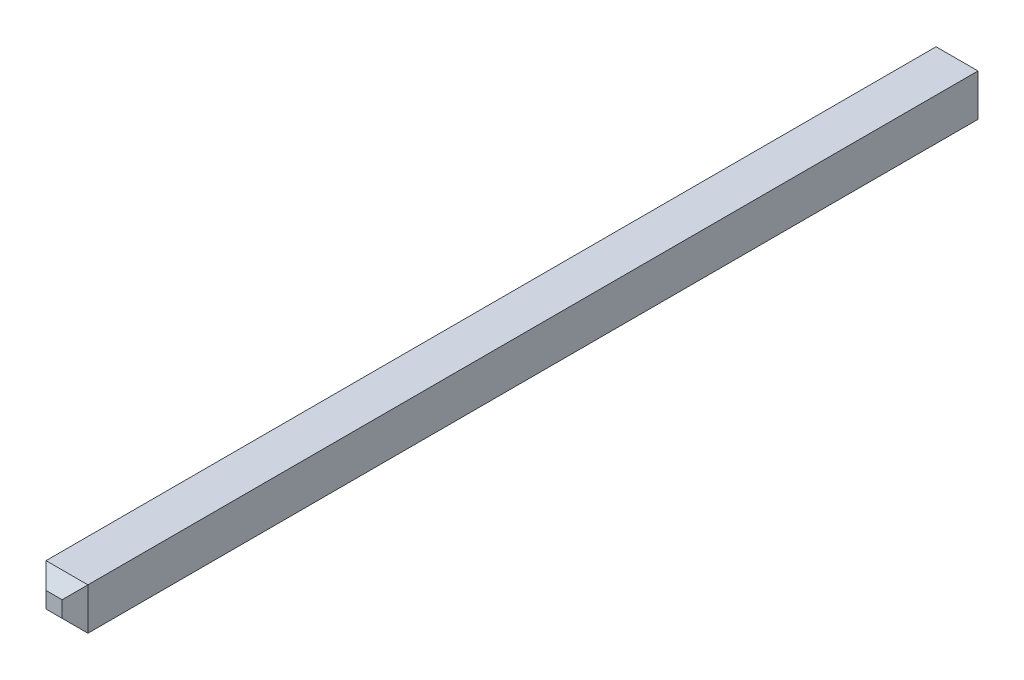
ISO-10303-21;
HEADER;
FILE_DESCRIPTION(('STEP AP214'),'2;1');
FILE_NAME('part.step','',(''),(''),'','','');
FILE_SCHEMA(('AUTOMOTIVE_DESIGN { 1 0 10303 214 1 1 1 1 }'));
ENDSEC;
DATA;
#1=APPLICATION_CONTEXT('core data for automotive mechanical design processes');
#2=APPLICATION_PROTOCOL_DEFINITION('international standard','automotive_design',2000,#1);
#3=PRODUCT_CONTEXT('',#1,'mechanical');
#4=PRODUCT('Part','Part','',(#3));
#5=PRODUCT_RELATED_PRODUCT_CATEGORY('part','',(#4));
#6=PRODUCT_DEFINITION_FORMATION('','',#4);
#7=PRODUCT_DEFINITION_CONTEXT('part definition',#1,'design');
#8=PRODUCT_DEFINITION('design','',#6,#7);
#9=PRODUCT_DEFINITION_SHAPE('','',#8);
#10=(LENGTH_UNIT() NAMED_UNIT(*) SI_UNIT(.MILLI.,.METRE.));
#11=(NAMED_UNIT(*) PLANE_ANGLE_UNIT() SI_UNIT($,.RADIAN.));
#12=(NAMED_UNIT(*) SI_UNIT($,.STERADIAN.) SOLID_ANGLE_UNIT());
#13=UNCERTAINTY_MEASURE_WITH_UNIT(LENGTH_MEASURE(1.E-05),#10,'distance_accuracy_value','');
#14=(GEOMETRIC_REPRESENTATION_CONTEXT(3) GLOBAL_UNCERTAINTY_ASSIGNED_CONTEXT((#13)) GLOBAL_UNIT_ASSIGNED_CONTEXT((#10,
#11,#12)) REPRESENTATION_CONTEXT('',''));
#15=CARTESIAN_POINT('',(0.,0.,0.));
#16=DIRECTION('',(0.,0.,1.));
#17=DIRECTION('',(1.,0.,0.));
#18=AXIS2_PLACEMENT_3D('',#15,#16,#17);
#19=CARTESIAN_POINT('',(-0.225,0.,-0.1));
#20=DIRECTION('',(-0.707106781186548,0.,0.707106781186548));
#21=DIRECTION('',(0.707106781186548,0.,0.707106781186548));
#22=AXIS2_PLACEMENT_3D('',#19,#20,#21);
#23=PLANE('',#22);
#24=DIRECTION('',(0.,1.,0.));
#25=VECTOR('',#24,1.);
#26=CARTESIAN_POINT('',(-0.325,0.325,-0.2));
#27=LINE('',#26,#25);
#28=CARTESIAN_POINT('',(-0.325,-0.325,-0.2));
#29=VERTEX_POINT('',#28);
#30=CARTESIAN_POINT('',(-0.325,0.325,-0.2));
#31=VERTEX_POINT('',#30);
#32=EDGE_CURVE('E112',#29,#31,#27,.T.);
#33=ORIENTED_EDGE('',*,*,#32,.F.);
#34=DIRECTION('',(-0.577350269189626,-0.577350269189626,-0.577350269189626));
#35=VECTOR('',#34,1.);
#36=CARTESIAN_POINT('',(-0.125,-0.125,0.));
#37=LINE('',#36,#35);
#38=CARTESIAN_POINT('',(-0.125,-0.125,0.));
#39=VERTEX_POINT('',#38);
#40=EDGE_CURVE('E110',#39,#29,#37,.T.);
#41=ORIENTED_EDGE('',*,*,#40,.F.);
#42=DIRECTION('',(0.,1.,0.));
#43=VECTOR('',#42,1.);
#44=CARTESIAN_POINT('',(-0.125,0.,0.));
#45=LINE('',#44,#43);
#46=CARTESIAN_POINT('',(-0.125,0.125,0.));
#47=VERTEX_POINT('',#46);
#48=EDGE_CURVE('E19',#47,#39,#45,.F.);
#49=ORIENTED_EDGE('',*,*,#48,.F.);
#50=DIRECTION('',(0.577350269189626,-0.577350269189626,0.577350269189626));
#51=VECTOR('',#50,1.);
#52=CARTESIAN_POINT('',(-0.325,0.325,-0.2));
#53=LINE('',#52,#51);
#54=EDGE_CURVE('E136',#31,#47,#53,.T.);
#55=ORIENTED_EDGE('',*,*,#54,.F.);
#56=EDGE_LOOP('',(#33,#41,#49,#55));
#57=FACE_BOUND('',#56,.T.);
#58=ADVANCED_FACE('F16',(#57),#23,.T.);
#59=CARTESIAN_POINT('',(-0.225,0.,-14.1));
#60=DIRECTION('',(-0.707106781186548,0.,-0.707106781186548));
#61=DIRECTION('',(-0.707106781186548,0.,0.707106781186548));
#62=AXIS2_PLACEMENT_3D('',#59,#60,#61);
#63=PLANE('',#62);
#64=DIRECTION('',(0.,1.,0.));
#65=VECTOR('',#64,1.);
#66=CARTESIAN_POINT('',(-0.125,0.,-14.2));
#67=LINE('',#66,#65);
#68=CARTESIAN_POINT('',(-0.125,0.125,-14.2));
#69=VERTEX_POINT('',#68);
#70=CARTESIAN_POINT('',(-0.125,-0.125,-14.2));
#71=VERTEX_POINT('',#70);
#72=EDGE_CURVE('E93',#69,#71,#67,.F.);
#73=ORIENTED_EDGE('',*,*,#72,.T.);
#74=DIRECTION('',(0.577350269189625,0.577350269189626,-0.577350269189626));
#75=VECTOR('',#74,1.);
#76=CARTESIAN_POINT('',(-0.325,-0.325000000000001,-14.));
#77=LINE('',#76,#75);
#78=CARTESIAN_POINT('',(-0.325,-0.325,-14.));
#79=VERTEX_POINT('',#78);
#80=EDGE_CURVE('E128',#79,#71,#77,.T.);
#81=ORIENTED_EDGE('',*,*,#80,.F.);
#82=DIRECTION('',(0.,1.,0.));
#83=VECTOR('',#82,1.);
#84=CARTESIAN_POINT('',(-0.325,0.325,-14.));
#85=LINE('',#84,#83);
#86=CARTESIAN_POINT('',(-0.325,0.325,-14.));
#87=VERTEX_POINT('',#86);
#88=EDGE_CURVE('E147',#87,#79,#85,.F.);
#89=ORIENTED_EDGE('',*,*,#88,.F.);
#90=DIRECTION('',(-0.577350269189625,0.577350269189626,0.577350269189626));
#91=VECTOR('',#90,1.);
#92=CARTESIAN_POINT('',(-0.125,0.125,-14.2));
#93=LINE('',#92,#91);
#94=EDGE_CURVE('E143',#69,#87,#93,.T.);
#95=ORIENTED_EDGE('',*,*,#94,.F.);
#96=EDGE_LOOP('',(#73,#81,#89,#95));
#97=FACE_BOUND('',#96,.T.);
#98=ADVANCED_FACE('F323',(#97),#63,.T.);
#99=CARTESIAN_POINT('',(0.,0.,0.));
#100=DIRECTION('',(0.,0.,1.));
#101=DIRECTION('',(1.,0.,0.));
#102=AXIS2_PLACEMENT_3D('',#99,#100,#101);
#103=PLANE('',#102);
#104=ORIENTED_EDGE('',*,*,#48,.T.);
#105=DIRECTION('',(1.,0.,0.));
#106=VECTOR('',#105,1.);
#107=CARTESIAN_POINT('',(0.,-0.125,0.));
#108=LINE('',#107,#106);
#109=CARTESIAN_POINT('',(0.125,-0.125,0.));
#110=VERTEX_POINT('',#109);
#111=EDGE_CURVE('E103',#110,#39,#108,.F.);
#112=ORIENTED_EDGE('',*,*,#111,.F.);
#113=DIRECTION('',(0.,1.,0.));
#114=VECTOR('',#113,1.);
#115=CARTESIAN_POINT('',(0.125,0.,0.));
#116=LINE('',#115,#114);
#117=CARTESIAN_POINT('',(0.125,0.125,0.));
#118=VERTEX_POINT('',#117);
#119=EDGE_CURVE('E155',#118,#110,#116,.F.);
#120=ORIENTED_EDGE('',*,*,#119,.F.);
#121=DIRECTION('',(1.,0.,0.));
#122=VECTOR('',#121,1.);
#123=CARTESIAN_POINT('',(0.,0.125,0.));
#124=LINE('',#123,#122);
#125=EDGE_CURVE('E105',#47,#118,#124,.T.);
#126=ORIENTED_EDGE('',*,*,#125,.F.);
#127=EDGE_LOOP('',(#104,#112,#120,#126));
#128=FACE_BOUND('',#127,.T.);
#129=ADVANCED_FACE('F100',(#128),#103,.T.);
#130=CARTESIAN_POINT('',(0.,-0.225,-0.1));
#131=DIRECTION('',(0.,-0.707106781186548,0.707106781186548));
#132=DIRECTION('',(0.,-0.707106781186548,-0.707106781186548));
#133=AXIS2_PLACEMENT_3D('',#130,#131,#132);
#134=PLANE('',#133);
#135=ORIENTED_EDGE('',*,*,#111,.T.);
#136=ORIENTED_EDGE('',*,*,#40,.T.);
#137=DIRECTION('',(1.,0.,0.));
#138=VECTOR('',#137,1.);
#139=CARTESIAN_POINT('',(-0.325,-0.325,-0.2));
#140=LINE('',#139,#138);
#141=CARTESIAN_POINT('',(0.325,-0.325,-0.2));
#142=VERTEX_POINT('',#141);
#143=EDGE_CURVE('E159',#142,#29,#140,.F.);
#144=ORIENTED_EDGE('',*,*,#143,.F.);
#145=DIRECTION('',(0.577350269189626,-0.577350269189626,-0.577350269189626));
#146=VECTOR('',#145,1.);
#147=CARTESIAN_POINT('',(0.125,-0.125,0.));
#148=LINE('',#147,#146);
#149=EDGE_CURVE('E119',#110,#142,#148,.T.);
#150=ORIENTED_EDGE('',*,*,#149,.F.);
#151=EDGE_LOOP('',(#135,#136,#144,#150));
#152=FACE_BOUND('',#151,.T.);
#153=ADVANCED_FACE('F117',(#152),#134,.T.);
#154=CARTESIAN_POINT('',(0.,0.,-14.2));
#155=DIRECTION('',(0.,0.,1.));
#156=DIRECTION('',(1.,0.,0.));
#157=AXIS2_PLACEMENT_3D('',#154,#155,#156);
#158=PLANE('',#157);
#159=DIRECTION('',(0.,1.,0.));
#160=VECTOR('',#159,1.);
#161=CARTESIAN_POINT('',(0.125,0.,-14.2));
#162=LINE('',#161,#160);
#163=CARTESIAN_POINT('',(0.125,-0.125,-14.2));
#164=VERTEX_POINT('',#163);
#165=CARTESIAN_POINT('',(0.125,0.125,-14.2));
#166=VERTEX_POINT('',#165);
#167=EDGE_CURVE('E171',#164,#166,#162,.T.);
#168=ORIENTED_EDGE('',*,*,#167,.F.);
#169=DIRECTION('',(1.,0.,0.));
#170=VECTOR('',#169,1.);
#171=CARTESIAN_POINT('',(0.,-0.125,-14.2));
#172=LINE('',#171,#170);
#173=EDGE_CURVE('E132',#71,#164,#172,.T.);
#174=ORIENTED_EDGE('',*,*,#173,.F.);
#175=ORIENTED_EDGE('',*,*,#72,.F.);
#176=DIRECTION('',(1.,0.,0.));
#177=VECTOR('',#176,1.);
#178=CARTESIAN_POINT('',(0.,0.125,-14.2));
#179=LINE('',#178,#177);
#180=EDGE_CURVE('E140',#166,#69,#179,.F.);
#181=ORIENTED_EDGE('',*,*,#180,.F.);
#182=EDGE_LOOP('',(#168,#174,#175,#181));
#183=FACE_BOUND('',#182,.T.);
#184=ADVANCED_FACE('F299',(#183),#158,.F.);
#185=CARTESIAN_POINT('',(0.,-0.225,-14.1));
#186=DIRECTION('',(0.,-0.707106781186548,-0.707106781186548));
#187=DIRECTION('',(0.,0.707106781186548,-0.707106781186548));
#188=AXIS2_PLACEMENT_3D('',#185,#186,#187);
#189=PLANE('',#188);
#190=ORIENTED_EDGE('',*,*,#173,.T.);
#191=DIRECTION('',(-0.577350269189626,0.577350269189625,-0.577350269189626));
#192=VECTOR('',#191,1.);
#193=CARTESIAN_POINT('',(0.325000000000001,-0.325,-14.));
#194=LINE('',#193,#192);
#195=CARTESIAN_POINT('',(0.325,-0.325,-14.));
#196=VERTEX_POINT('',#195);
#197=EDGE_CURVE('E178',#196,#164,#194,.T.);
#198=ORIENTED_EDGE('',*,*,#197,.F.);
#199=DIRECTION('',(1.,0.,0.));
#200=VECTOR('',#199,1.);
#201=CARTESIAN_POINT('',(-0.325,-0.325,-14.));
#202=LINE('',#201,#200);
#203=EDGE_CURVE('E167',#79,#196,#202,.T.);
#204=ORIENTED_EDGE('',*,*,#203,.F.);
#205=ORIENTED_EDGE('',*,*,#80,.T.);
#206=EDGE_LOOP('',(#190,#198,#204,#205));
#207=FACE_BOUND('',#206,.T.);
#208=ADVANCED_FACE('F291',(#207),#189,.T.);
#209=CARTESIAN_POINT('',(0.,0.225,-0.1));
#210=DIRECTION('',(0.,0.707106781186548,0.707106781186548));
#211=DIRECTION('',(0.,-0.707106781186548,0.707106781186548));
#212=AXIS2_PLACEMENT_3D('',#209,#210,#211);
#213=PLANE('',#212);
#214=ORIENTED_EDGE('',*,*,#125,.T.);
#215=DIRECTION('',(-0.577350269189626,-0.577350269189626,0.577350269189626));
#216=VECTOR('',#215,1.);
#217=CARTESIAN_POINT('',(0.325,0.325,-0.2));
#218=LINE('',#217,#216);
#219=CARTESIAN_POINT('',(0.325,0.325,-0.2));
#220=VERTEX_POINT('',#219);
#221=EDGE_CURVE('E151',#220,#118,#218,.T.);
#222=ORIENTED_EDGE('',*,*,#221,.F.);
#223=DIRECTION('',(1.,0.,0.));
#224=VECTOR('',#223,1.);
#225=CARTESIAN_POINT('',(0.325,0.325,-0.2));
#226=LINE('',#225,#224);
#227=EDGE_CURVE('E182',#31,#220,#226,.T.);
#228=ORIENTED_EDGE('',*,*,#227,.F.);
#229=ORIENTED_EDGE('',*,*,#54,.T.);
#230=EDGE_LOOP('',(#214,#222,#228,#229));
#231=FACE_BOUND('',#230,.T.);
#232=ADVANCED_FACE('F213',(#231),#213,.T.);
#233=CARTESIAN_POINT('',(0.,0.225,-14.1));
#234=DIRECTION('',(0.,0.707106781186548,-0.707106781186548));
#235=DIRECTION('',(0.,0.707106781186548,0.707106781186548));
#236=AXIS2_PLACEMENT_3D('',#233,#234,#235);
#237=PLANE('',#236);
#238=DIRECTION('',(1.,0.,0.));
#239=VECTOR('',#238,1.);
#240=CARTESIAN_POINT('',(0.325,0.325,-14.));
#241=LINE('',#240,#239);
#242=CARTESIAN_POINT('',(0.325,0.325,-14.));
#243=VERTEX_POINT('',#242);
#244=EDGE_CURVE('E39',#243,#87,#241,.F.);
#245=ORIENTED_EDGE('',*,*,#244,.F.);
#246=DIRECTION('',(0.577350269189626,0.577350269189625,0.577350269189626));
#247=VECTOR('',#246,1.);
#248=CARTESIAN_POINT('',(0.125,0.125,-14.2));
#249=LINE('',#248,#247);
#250=EDGE_CURVE('E175',#166,#243,#249,.T.);
#251=ORIENTED_EDGE('',*,*,#250,.F.);
#252=ORIENTED_EDGE('',*,*,#180,.T.);
#253=ORIENTED_EDGE('',*,*,#94,.T.);
#254=EDGE_LOOP('',(#245,#251,#252,#253));
#255=FACE_BOUND('',#254,.T.);
#256=ADVANCED_FACE('F230',(#255),#237,.T.);
#257=CARTESIAN_POINT('',(-0.325,0.325,0.));
#258=DIRECTION('',(-1.,0.,0.));
#259=DIRECTION('',(0.,0.,1.));
#260=AXIS2_PLACEMENT_3D('',#257,#258,#259);
#261=PLANE('',#260);
#262=ORIENTED_EDGE('',*,*,#88,.T.);
#263=DIRECTION('',(0.,0.,-1.));
#264=VECTOR('',#263,1.);
#265=CARTESIAN_POINT('',(-0.325,-0.325,0.));
#266=LINE('',#265,#264);
#267=EDGE_CURVE('E163',#29,#79,#266,.T.);
#268=ORIENTED_EDGE('',*,*,#267,.F.);
#269=ORIENTED_EDGE('',*,*,#32,.T.);
#270=DIRECTION('',(0.,0.,1.));
#271=VECTOR('',#270,1.);
#272=CARTESIAN_POINT('',(-0.325,0.325,0.));
#273=LINE('',#272,#271);
#274=EDGE_CURVE('E187',#87,#31,#273,.T.);
#275=ORIENTED_EDGE('',*,*,#274,.F.);
#276=EDGE_LOOP('',(#262,#268,#269,#275));
#277=FACE_BOUND('',#276,.T.);
#278=ADVANCED_FACE('F216',(#277),#261,.T.);
#279=CARTESIAN_POINT('',(0.225,0.,-0.1));
#280=DIRECTION('',(0.707106781186548,0.,0.707106781186548));
#281=DIRECTION('',(0.707106781186548,0.,-0.707106781186548));
#282=AXIS2_PLACEMENT_3D('',#279,#280,#281);
#283=PLANE('',#282);
#284=ORIENTED_EDGE('',*,*,#119,.T.);
#285=ORIENTED_EDGE('',*,*,#149,.T.);
#286=DIRECTION('',(0.,1.,0.));
#287=VECTOR('',#286,1.);
#288=CARTESIAN_POINT('',(0.325,-0.325,-0.2));
#289=LINE('',#288,#287);
#290=EDGE_CURVE('E191',#220,#142,#289,.F.);
#291=ORIENTED_EDGE('',*,*,#290,.F.);
#292=ORIENTED_EDGE('',*,*,#221,.T.);
#293=EDGE_LOOP('',(#284,#285,#291,#292));
#294=FACE_BOUND('',#293,.T.);
#295=ADVANCED_FACE('F221',(#294),#283,.T.);
#296=CARTESIAN_POINT('',(-0.325,-0.325,0.));
#297=DIRECTION('',(0.,-1.,0.));
#298=DIRECTION('',(0.,0.,-1.));
#299=AXIS2_PLACEMENT_3D('',#296,#297,#298);
#300=PLANE('',#299);
#301=ORIENTED_EDGE('',*,*,#203,.T.);
#302=DIRECTION('',(0.,0.,-1.));
#303=VECTOR('',#302,1.);
#304=CARTESIAN_POINT('',(0.325,-0.325,0.));
#305=LINE('',#304,#303);
#306=EDGE_CURVE('E195',#142,#196,#305,.T.);
#307=ORIENTED_EDGE('',*,*,#306,.F.);
#308=ORIENTED_EDGE('',*,*,#143,.T.);
#309=ORIENTED_EDGE('',*,*,#267,.T.);
#310=EDGE_LOOP('',(#301,#307,#308,#309));
#311=FACE_BOUND('',#310,.T.);
#312=ADVANCED_FACE('F219',(#311),#300,.T.);
#313=CARTESIAN_POINT('',(0.225,0.,-14.1));
#314=DIRECTION('',(0.707106781186548,0.,-0.707106781186548));
#315=DIRECTION('',(-0.707106781186548,0.,-0.707106781186548));
#316=AXIS2_PLACEMENT_3D('',#313,#314,#315);
#317=PLANE('',#316);
#318=DIRECTION('',(0.,1.,0.));
#319=VECTOR('',#318,1.);
#320=CARTESIAN_POINT('',(0.325,-0.325,-14.));
#321=LINE('',#320,#319);
#322=EDGE_CURVE('E26',#196,#243,#321,.T.);
#323=ORIENTED_EDGE('',*,*,#322,.F.);
#324=ORIENTED_EDGE('',*,*,#197,.T.);
#325=ORIENTED_EDGE('',*,*,#167,.T.);
#326=ORIENTED_EDGE('',*,*,#250,.T.);
#327=EDGE_LOOP('',(#323,#324,#325,#326));
#328=FACE_BOUND('',#327,.T.);
#329=ADVANCED_FACE('F207',(#328),#317,.T.);
#330=CARTESIAN_POINT('',(0.325,0.325,0.));
#331=DIRECTION('',(0.,1.,0.));
#332=DIRECTION('',(0.,0.,1.));
#333=AXIS2_PLACEMENT_3D('',#330,#331,#332);
#334=PLANE('',#333);
#335=ORIENTED_EDGE('',*,*,#244,.T.);
#336=ORIENTED_EDGE('',*,*,#274,.T.);
#337=ORIENTED_EDGE('',*,*,#227,.T.);
#338=DIRECTION('',(0.,0.,-1.));
#339=VECTOR('',#338,1.);
#340=CARTESIAN_POINT('',(0.325,0.325,0.));
#341=LINE('',#340,#339);
#342=EDGE_CURVE('E11',#243,#220,#341,.F.);
#343=ORIENTED_EDGE('',*,*,#342,.F.);
#344=EDGE_LOOP('',(#335,#336,#337,#343));
#345=FACE_BOUND('',#344,.T.);
#346=ADVANCED_FACE('F209',(#345),#334,.T.);
#347=CARTESIAN_POINT('',(0.325,-0.325,0.));
#348=DIRECTION('',(1.,0.,0.));
#349=DIRECTION('',(0.,0.,-1.));
#350=AXIS2_PLACEMENT_3D('',#347,#348,#349);
#351=PLANE('',#350);
#352=ORIENTED_EDGE('',*,*,#322,.T.);
#353=ORIENTED_EDGE('',*,*,#342,.T.);
#354=ORIENTED_EDGE('',*,*,#290,.T.);
#355=ORIENTED_EDGE('',*,*,#306,.T.);
#356=EDGE_LOOP('',(#352,#353,#354,#355));
#357=FACE_BOUND('',#356,.T.);
#358=ADVANCED_FACE('F203',(#357),#351,.T.);
#359=CLOSED_SHELL('',(#58,#98,#129,#153,#184,#208,#232,#256,#278,#295,#312,#329,#346,#358));
#360=MANIFOLD_SOLID_BREP('B1',#359);
#361=ADVANCED_BREP_SHAPE_REPRESENTATION('',(#18,#360),#14);
#362=SHAPE_DEFINITION_REPRESENTATION(#9,#361);
ENDSEC;
END-ISO-10303-21;
